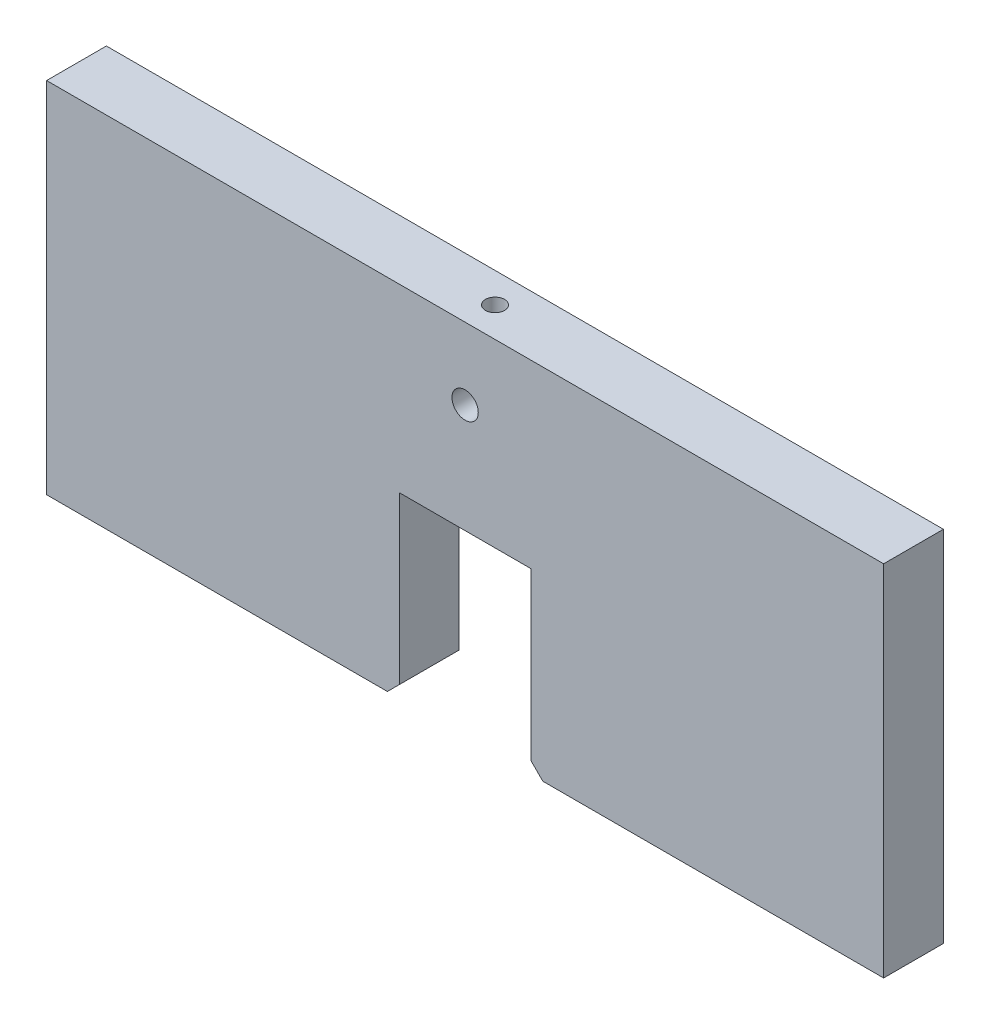
ISO-10303-21;
HEADER;
FILE_DESCRIPTION(('STEP AP214'),'2;1');
FILE_NAME('part.step','',(''),(''),'','','');
FILE_SCHEMA(('AUTOMOTIVE_DESIGN { 1 0 10303 214 1 1 1 1 }'));
ENDSEC;
DATA;
#1=APPLICATION_CONTEXT('core data for automotive mechanical design processes');
#2=APPLICATION_PROTOCOL_DEFINITION('international standard','automotive_design',2000,#1);
#3=PRODUCT_CONTEXT('',#1,'mechanical');
#4=PRODUCT('Part','Part','',(#3));
#5=PRODUCT_RELATED_PRODUCT_CATEGORY('part','',(#4));
#6=PRODUCT_DEFINITION_FORMATION('','',#4);
#7=PRODUCT_DEFINITION_CONTEXT('part definition',#1,'design');
#8=PRODUCT_DEFINITION('design','',#6,#7);
#9=PRODUCT_DEFINITION_SHAPE('','',#8);
#10=(LENGTH_UNIT() NAMED_UNIT(*) SI_UNIT(.MILLI.,.METRE.));
#11=(NAMED_UNIT(*) PLANE_ANGLE_UNIT() SI_UNIT($,.RADIAN.));
#12=(NAMED_UNIT(*) SI_UNIT($,.STERADIAN.) SOLID_ANGLE_UNIT());
#13=UNCERTAINTY_MEASURE_WITH_UNIT(LENGTH_MEASURE(1.E-05),#10,'distance_accuracy_value','');
#14=(GEOMETRIC_REPRESENTATION_CONTEXT(3) GLOBAL_UNCERTAINTY_ASSIGNED_CONTEXT((#13)) GLOBAL_UNIT_ASSIGNED_CONTEXT((#10,
#11,#12)) REPRESENTATION_CONTEXT('',''));
#15=CARTESIAN_POINT('',(0.,0.,0.));
#16=DIRECTION('',(0.,0.,1.));
#17=DIRECTION('',(1.,0.,0.));
#18=AXIS2_PLACEMENT_3D('',#15,#16,#17);
#19=CARTESIAN_POINT('',(-350.,232.421392473446,25.));
#20=DIRECTION('',(1.,0.,0.));
#21=DIRECTION('',(0.,1.,0.));
#22=AXIS2_PLACEMENT_3D('',#19,#20,#21);
#23=PLANE('',#22);
#24=DIRECTION('',(0.,-1.,0.));
#25=VECTOR('',#24,1.);
#26=CARTESIAN_POINT('',(-350.,232.421392473446,-25.));
#27=LINE('',#26,#25);
#28=CARTESIAN_POINT('',(-350.,232.421392473446,-25.));
#29=VERTEX_POINT('',#28);
#30=CARTESIAN_POINT('',(-350.,-67.5786075265541,-25.));
#31=VERTEX_POINT('',#30);
#32=EDGE_CURVE('E141',#29,#31,#27,.T.);
#33=ORIENTED_EDGE('',*,*,#32,.T.);
#34=DIRECTION('',(0.,0.,-1.));
#35=VECTOR('',#34,1.);
#36=CARTESIAN_POINT('',(-350.,-67.5786075265541,25.));
#37=LINE('',#36,#35);
#38=CARTESIAN_POINT('',(-350.,-67.5786075265541,25.));
#39=VERTEX_POINT('',#38);
#40=EDGE_CURVE('E11',#39,#31,#37,.T.);
#41=ORIENTED_EDGE('',*,*,#40,.F.);
#42=DIRECTION('',(0.,-1.,0.));
#43=VECTOR('',#42,1.);
#44=CARTESIAN_POINT('',(-350.,232.421392473446,25.));
#45=LINE('',#44,#43);
#46=CARTESIAN_POINT('',(-350.,232.421392473446,25.));
#47=VERTEX_POINT('',#46);
#48=EDGE_CURVE('E160',#47,#39,#45,.T.);
#49=ORIENTED_EDGE('',*,*,#48,.F.);
#50=DIRECTION('',(0.,0.,-1.));
#51=VECTOR('',#50,1.);
#52=CARTESIAN_POINT('',(-350.,232.421392473446,25.));
#53=LINE('',#52,#51);
#54=EDGE_CURVE('E137',#47,#29,#53,.T.);
#55=ORIENTED_EDGE('',*,*,#54,.T.);
#56=EDGE_LOOP('',(#33,#41,#49,#55));
#57=FACE_BOUND('',#56,.T.);
#58=ADVANCED_FACE('F33',(#57),#23,.F.);
#59=CARTESIAN_POINT('',(-350.,-67.5786075265541,25.));
#60=DIRECTION('',(0.,1.,0.));
#61=DIRECTION('',(-1.,0.,0.));
#62=AXIS2_PLACEMENT_3D('',#59,#60,#61);
#63=PLANE('',#62);
#64=CARTESIAN_POINT('',(-80.,-67.5786075265541,0.));
#65=DIRECTION('',(0.,-1.,0.));
#66=DIRECTION('',(1.,0.,0.));
#67=AXIS2_PLACEMENT_3D('',#64,#65,#66);
#68=CIRCLE('',#67,8.);
#69=CARTESIAN_POINT('',(-72.,-67.5786075265541,0.));
#70=VERTEX_POINT('',#69);
#71=EDGE_CURVE('E219',#70,#70,#68,.T.);
#72=ORIENTED_EDGE('',*,*,#71,.F.);
#73=EDGE_LOOP('',(#72));
#74=FACE_BOUND('',#73,.T.);
#75=DIRECTION('',(1.,0.,0.));
#76=VECTOR('',#75,1.);
#77=CARTESIAN_POINT('',(-350.,-67.5786075265541,-25.));
#78=LINE('',#77,#76);
#79=CARTESIAN_POINT('',(-65.,-67.5786075265541,-25.));
#80=VERTEX_POINT('',#79);
#81=EDGE_CURVE('E144',#31,#80,#78,.T.);
#82=ORIENTED_EDGE('',*,*,#81,.T.);
#83=DIRECTION('',(0.,0.,-1.));
#84=VECTOR('',#83,1.);
#85=CARTESIAN_POINT('',(-65.,-67.5786075265541,25.));
#86=LINE('',#85,#84);
#87=CARTESIAN_POINT('',(-65.,-67.5786075265541,25.));
#88=VERTEX_POINT('',#87);
#89=EDGE_CURVE('E41',#88,#80,#86,.T.);
#90=ORIENTED_EDGE('',*,*,#89,.F.);
#91=DIRECTION('',(1.,0.,0.));
#92=VECTOR('',#91,1.);
#93=CARTESIAN_POINT('',(-350.,-67.5786075265541,25.));
#94=LINE('',#93,#92);
#95=EDGE_CURVE('E98',#39,#88,#94,.T.);
#96=ORIENTED_EDGE('',*,*,#95,.F.);
#97=ORIENTED_EDGE('',*,*,#40,.T.);
#98=EDGE_LOOP('',(#82,#90,#96,#97));
#99=FACE_BOUND('',#98,.T.);
#100=ADVANCED_FACE('F255',(#74,#99),#63,.F.);
#101=CARTESIAN_POINT('',(-65.,-67.5786075265541,25.));
#102=DIRECTION('',(-0.707106781186546,0.707106781186549,0.));
#103=DIRECTION('',(-0.707106781186549,-0.707106781186546,0.));
#104=AXIS2_PLACEMENT_3D('',#101,#102,#103);
#105=PLANE('',#104);
#106=DIRECTION('',(0.707106781186549,0.707106781186546,0.));
#107=VECTOR('',#106,1.);
#108=CARTESIAN_POINT('',(-65.,-67.5786075265541,-25.));
#109=LINE('',#108,#107);
#110=CARTESIAN_POINT('',(-55.,-57.5786075265541,-25.));
#111=VERTEX_POINT('',#110);
#112=EDGE_CURVE('E147',#80,#111,#109,.T.);
#113=ORIENTED_EDGE('',*,*,#112,.T.);
#114=DIRECTION('',(0.,0.,-1.));
#115=VECTOR('',#114,1.);
#116=CARTESIAN_POINT('',(-55.,-57.5786075265541,25.));
#117=LINE('',#116,#115);
#118=CARTESIAN_POINT('',(-55.,-57.5786075265541,25.));
#119=VERTEX_POINT('',#118);
#120=EDGE_CURVE('E173',#119,#111,#117,.T.);
#121=ORIENTED_EDGE('',*,*,#120,.F.);
#122=DIRECTION('',(0.707106781186549,0.707106781186546,0.));
#123=VECTOR('',#122,1.);
#124=CARTESIAN_POINT('',(-65.,-67.5786075265541,25.));
#125=LINE('',#124,#123);
#126=EDGE_CURVE('E181',#88,#119,#125,.T.);
#127=ORIENTED_EDGE('',*,*,#126,.F.);
#128=ORIENTED_EDGE('',*,*,#89,.T.);
#129=EDGE_LOOP('',(#113,#121,#127,#128));
#130=FACE_BOUND('',#129,.T.);
#131=ADVANCED_FACE('F179',(#130),#105,.F.);
#132=CARTESIAN_POINT('',(-55.,-57.5786075265541,25.));
#133=DIRECTION('',(-1.,0.,0.));
#134=DIRECTION('',(0.,0.,1.));
#135=AXIS2_PLACEMENT_3D('',#132,#133,#134);
#136=PLANE('',#135);
#137=DIRECTION('',(0.,1.,0.));
#138=VECTOR('',#137,1.);
#139=CARTESIAN_POINT('',(-55.,-57.5786075265541,-25.));
#140=LINE('',#139,#138);
#141=CARTESIAN_POINT('',(-55.,81.4213924734459,-25.));
#142=VERTEX_POINT('',#141);
#143=EDGE_CURVE('E149',#111,#142,#140,.T.);
#144=ORIENTED_EDGE('',*,*,#143,.T.);
#145=DIRECTION('',(0.,0.,-1.));
#146=VECTOR('',#145,1.);
#147=CARTESIAN_POINT('',(-55.,81.4213924734459,25.));
#148=LINE('',#147,#146);
#149=CARTESIAN_POINT('',(-55.,81.4213924734459,25.));
#150=VERTEX_POINT('',#149);
#151=EDGE_CURVE('E170',#150,#142,#148,.T.);
#152=ORIENTED_EDGE('',*,*,#151,.F.);
#153=DIRECTION('',(0.,1.,0.));
#154=VECTOR('',#153,1.);
#155=CARTESIAN_POINT('',(-55.,-57.5786075265541,25.));
#156=LINE('',#155,#154);
#157=EDGE_CURVE('E199',#119,#150,#156,.T.);
#158=ORIENTED_EDGE('',*,*,#157,.F.);
#159=ORIENTED_EDGE('',*,*,#120,.T.);
#160=EDGE_LOOP('',(#144,#152,#158,#159));
#161=FACE_BOUND('',#160,.T.);
#162=ADVANCED_FACE('F190',(#161),#136,.F.);
#163=CARTESIAN_POINT('',(-55.,81.4213924734459,25.));
#164=DIRECTION('',(0.,1.,0.));
#165=DIRECTION('',(0.,0.,1.));
#166=AXIS2_PLACEMENT_3D('',#163,#164,#165);
#167=PLANE('',#166);
#168=DIRECTION('',(1.,0.,0.));
#169=VECTOR('',#168,1.);
#170=CARTESIAN_POINT('',(-55.,81.4213924734459,-25.));
#171=LINE('',#170,#169);
#172=CARTESIAN_POINT('',(55.,81.4213924734459,-25.));
#173=VERTEX_POINT('',#172);
#174=EDGE_CURVE('E151',#142,#173,#171,.T.);
#175=ORIENTED_EDGE('',*,*,#174,.T.);
#176=DIRECTION('',(0.,0.,-1.));
#177=VECTOR('',#176,1.);
#178=CARTESIAN_POINT('',(55.,81.4213924734459,25.));
#179=LINE('',#178,#177);
#180=CARTESIAN_POINT('',(55.,81.4213924734459,25.));
#181=VERTEX_POINT('',#180);
#182=EDGE_CURVE('E167',#181,#173,#179,.T.);
#183=ORIENTED_EDGE('',*,*,#182,.F.);
#184=DIRECTION('',(1.,0.,0.));
#185=VECTOR('',#184,1.);
#186=CARTESIAN_POINT('',(-55.,81.4213924734459,25.));
#187=LINE('',#186,#185);
#188=EDGE_CURVE('E196',#150,#181,#187,.T.);
#189=ORIENTED_EDGE('',*,*,#188,.F.);
#190=ORIENTED_EDGE('',*,*,#151,.T.);
#191=EDGE_LOOP('',(#175,#183,#189,#190));
#192=FACE_BOUND('',#191,.T.);
#193=ADVANCED_FACE('F194',(#192),#167,.F.);
#194=CARTESIAN_POINT('',(55.,-57.5786075265541,25.));
#195=DIRECTION('',(1.,0.,0.));
#196=DIRECTION('',(0.,1.,0.));
#197=AXIS2_PLACEMENT_3D('',#194,#195,#196);
#198=PLANE('',#197);
#199=DIRECTION('',(0.,-1.,0.));
#200=VECTOR('',#199,1.);
#201=CARTESIAN_POINT('',(55.,-57.5786075265541,-25.));
#202=LINE('',#201,#200);
#203=CARTESIAN_POINT('',(55.,-57.5786075265541,-25.));
#204=VERTEX_POINT('',#203);
#205=EDGE_CURVE('E153',#173,#204,#202,.T.);
#206=ORIENTED_EDGE('',*,*,#205,.T.);
#207=DIRECTION('',(0.,0.,-1.));
#208=VECTOR('',#207,1.);
#209=CARTESIAN_POINT('',(55.,-57.5786075265541,25.));
#210=LINE('',#209,#208);
#211=CARTESIAN_POINT('',(55.,-57.5786075265541,25.));
#212=VERTEX_POINT('',#211);
#213=EDGE_CURVE('E164',#212,#204,#210,.T.);
#214=ORIENTED_EDGE('',*,*,#213,.F.);
#215=DIRECTION('',(0.,-1.,0.));
#216=VECTOR('',#215,1.);
#217=CARTESIAN_POINT('',(55.,-57.5786075265541,25.));
#218=LINE('',#217,#216);
#219=EDGE_CURVE('E198',#181,#212,#218,.T.);
#220=ORIENTED_EDGE('',*,*,#219,.F.);
#221=ORIENTED_EDGE('',*,*,#182,.T.);
#222=EDGE_LOOP('',(#206,#214,#220,#221));
#223=FACE_BOUND('',#222,.T.);
#224=ADVANCED_FACE('F251',(#223),#198,.F.);
#225=CARTESIAN_POINT('',(65.,-67.5786075265541,25.));
#226=DIRECTION('',(0.707106781186546,0.707106781186549,0.));
#227=DIRECTION('',(-0.707106781186549,0.707106781186546,0.));
#228=AXIS2_PLACEMENT_3D('',#225,#226,#227);
#229=PLANE('',#228);
#230=DIRECTION('',(0.707106781186549,-0.707106781186546,0.));
#231=VECTOR('',#230,1.);
#232=CARTESIAN_POINT('',(65.,-67.5786075265541,-25.));
#233=LINE('',#232,#231);
#234=CARTESIAN_POINT('',(65.,-67.5786075265541,-25.));
#235=VERTEX_POINT('',#234);
#236=EDGE_CURVE('E155',#204,#235,#233,.T.);
#237=ORIENTED_EDGE('',*,*,#236,.T.);
#238=DIRECTION('',(0.,0.,-1.));
#239=VECTOR('',#238,1.);
#240=CARTESIAN_POINT('',(65.,-67.5786075265541,25.));
#241=LINE('',#240,#239);
#242=CARTESIAN_POINT('',(65.,-67.5786075265541,25.));
#243=VERTEX_POINT('',#242);
#244=EDGE_CURVE('E132',#243,#235,#241,.T.);
#245=ORIENTED_EDGE('',*,*,#244,.F.);
#246=DIRECTION('',(0.707106781186549,-0.707106781186546,0.));
#247=VECTOR('',#246,1.);
#248=CARTESIAN_POINT('',(65.,-67.5786075265541,25.));
#249=LINE('',#248,#247);
#250=EDGE_CURVE('E123',#212,#243,#249,.T.);
#251=ORIENTED_EDGE('',*,*,#250,.F.);
#252=ORIENTED_EDGE('',*,*,#213,.T.);
#253=EDGE_LOOP('',(#237,#245,#251,#252));
#254=FACE_BOUND('',#253,.T.);
#255=ADVANCED_FACE('F241',(#254),#229,.F.);
#256=CARTESIAN_POINT('',(350.,-67.5786075265541,25.));
#257=DIRECTION('',(0.,1.,0.));
#258=DIRECTION('',(0.,0.,1.));
#259=AXIS2_PLACEMENT_3D('',#256,#257,#258);
#260=PLANE('',#259);
#261=CARTESIAN_POINT('',(80.,-67.578607526554,0.));
#262=DIRECTION('',(0.,-1.,0.));
#263=DIRECTION('',(1.,0.,0.));
#264=AXIS2_PLACEMENT_3D('',#261,#262,#263);
#265=CIRCLE('',#264,8.);
#266=CARTESIAN_POINT('',(88.,-67.578607526554,0.));
#267=VERTEX_POINT('',#266);
#268=EDGE_CURVE('E225',#267,#267,#265,.T.);
#269=ORIENTED_EDGE('',*,*,#268,.F.);
#270=EDGE_LOOP('',(#269));
#271=FACE_BOUND('',#270,.T.);
#272=DIRECTION('',(1.,0.,0.));
#273=VECTOR('',#272,1.);
#274=CARTESIAN_POINT('',(350.,-67.5786075265541,-25.));
#275=LINE('',#274,#273);
#276=CARTESIAN_POINT('',(350.,-67.5786075265541,-25.));
#277=VERTEX_POINT('',#276);
#278=EDGE_CURVE('E131',#235,#277,#275,.T.);
#279=ORIENTED_EDGE('',*,*,#278,.T.);
#280=DIRECTION('',(0.,0.,-1.));
#281=VECTOR('',#280,1.);
#282=CARTESIAN_POINT('',(350.,-67.5786075265541,25.));
#283=LINE('',#282,#281);
#284=CARTESIAN_POINT('',(350.,-67.5786075265541,25.));
#285=VERTEX_POINT('',#284);
#286=EDGE_CURVE('E128',#285,#277,#283,.T.);
#287=ORIENTED_EDGE('',*,*,#286,.F.);
#288=DIRECTION('',(1.,0.,0.));
#289=VECTOR('',#288,1.);
#290=CARTESIAN_POINT('',(350.,-67.5786075265541,25.));
#291=LINE('',#290,#289);
#292=EDGE_CURVE('E117',#243,#285,#291,.T.);
#293=ORIENTED_EDGE('',*,*,#292,.F.);
#294=ORIENTED_EDGE('',*,*,#244,.T.);
#295=EDGE_LOOP('',(#279,#287,#293,#294));
#296=FACE_BOUND('',#295,.T.);
#297=ADVANCED_FACE('F129',(#271,#296),#260,.F.);
#298=CARTESIAN_POINT('',(350.,232.421392473446,25.));
#299=DIRECTION('',(-1.,0.,0.));
#300=DIRECTION('',(0.,-1.,0.));
#301=AXIS2_PLACEMENT_3D('',#298,#299,#300);
#302=PLANE('',#301);
#303=DIRECTION('',(0.,1.,0.));
#304=VECTOR('',#303,1.);
#305=CARTESIAN_POINT('',(350.,232.421392473446,-25.));
#306=LINE('',#305,#304);
#307=CARTESIAN_POINT('',(350.,232.421392473446,-25.));
#308=VERTEX_POINT('',#307);
#309=EDGE_CURVE('E84',#277,#308,#306,.T.);
#310=ORIENTED_EDGE('',*,*,#309,.T.);
#311=DIRECTION('',(0.,0.,-1.));
#312=VECTOR('',#311,1.);
#313=CARTESIAN_POINT('',(350.,232.421392473446,25.));
#314=LINE('',#313,#312);
#315=CARTESIAN_POINT('',(350.,232.421392473446,25.));
#316=VERTEX_POINT('',#315);
#317=EDGE_CURVE('E133',#316,#308,#314,.T.);
#318=ORIENTED_EDGE('',*,*,#317,.F.);
#319=DIRECTION('',(0.,1.,0.));
#320=VECTOR('',#319,1.);
#321=CARTESIAN_POINT('',(350.,232.421392473446,25.));
#322=LINE('',#321,#320);
#323=EDGE_CURVE('E121',#285,#316,#322,.T.);
#324=ORIENTED_EDGE('',*,*,#323,.F.);
#325=ORIENTED_EDGE('',*,*,#286,.T.);
#326=EDGE_LOOP('',(#310,#318,#324,#325));
#327=FACE_BOUND('',#326,.T.);
#328=ADVANCED_FACE('F135',(#327),#302,.F.);
#329=CARTESIAN_POINT('',(350.,232.421392473446,25.));
#330=DIRECTION('',(0.,-1.,0.));
#331=DIRECTION('',(0.,0.,-1.));
#332=AXIS2_PLACEMENT_3D('',#329,#330,#331);
#333=PLANE('',#332);
#334=CARTESIAN_POINT('',(0.,232.421392473446,0.));
#335=DIRECTION('',(0.,1.,0.));
#336=DIRECTION('',(0.,0.,1.));
#337=AXIS2_PLACEMENT_3D('',#334,#335,#336);
#338=CIRCLE('',#337,8.);
#339=CARTESIAN_POINT('',(0.,232.421392473446,8.));
#340=VERTEX_POINT('',#339);
#341=EDGE_CURVE('E213',#340,#340,#338,.T.);
#342=ORIENTED_EDGE('',*,*,#341,.F.);
#343=EDGE_LOOP('',(#342));
#344=FACE_BOUND('',#343,.T.);
#345=DIRECTION('',(-1.,0.,0.));
#346=VECTOR('',#345,1.);
#347=CARTESIAN_POINT('',(350.,232.421392473446,-25.));
#348=LINE('',#347,#346);
#349=EDGE_CURVE('E90',#308,#29,#348,.T.);
#350=ORIENTED_EDGE('',*,*,#349,.T.);
#351=ORIENTED_EDGE('',*,*,#54,.F.);
#352=DIRECTION('',(-1.,0.,0.));
#353=VECTOR('',#352,1.);
#354=CARTESIAN_POINT('',(350.,232.421392473446,25.));
#355=LINE('',#354,#353);
#356=EDGE_CURVE('E49',#316,#47,#355,.T.);
#357=ORIENTED_EDGE('',*,*,#356,.F.);
#358=ORIENTED_EDGE('',*,*,#317,.T.);
#359=EDGE_LOOP('',(#350,#351,#357,#358));
#360=FACE_BOUND('',#359,.T.);
#361=ADVANCED_FACE('F248',(#344,#360),#333,.F.);
#362=CARTESIAN_POINT('',(0.,0.,25.));
#363=DIRECTION('',(0.,0.,1.));
#364=DIRECTION('',(1.,0.,0.));
#365=AXIS2_PLACEMENT_3D('',#362,#363,#364);
#366=PLANE('',#365);
#367=CARTESIAN_POINT('',(0.,172.421392473446,25.));
#368=DIRECTION('',(0.,0.,1.));
#369=DIRECTION('',(1.,0.,0.));
#370=AXIS2_PLACEMENT_3D('',#367,#368,#369);
#371=CIRCLE('',#370,11.);
#372=CARTESIAN_POINT('',(11.,172.421392473446,25.));
#373=VERTEX_POINT('',#372);
#374=EDGE_CURVE('E209',#373,#373,#371,.T.);
#375=ORIENTED_EDGE('',*,*,#374,.F.);
#376=EDGE_LOOP('',(#375));
#377=FACE_BOUND('',#376,.T.);
#378=ORIENTED_EDGE('',*,*,#48,.T.);
#379=ORIENTED_EDGE('',*,*,#95,.T.);
#380=ORIENTED_EDGE('',*,*,#126,.T.);
#381=ORIENTED_EDGE('',*,*,#157,.T.);
#382=ORIENTED_EDGE('',*,*,#188,.T.);
#383=ORIENTED_EDGE('',*,*,#219,.T.);
#384=ORIENTED_EDGE('',*,*,#250,.T.);
#385=ORIENTED_EDGE('',*,*,#292,.T.);
#386=ORIENTED_EDGE('',*,*,#323,.T.);
#387=ORIENTED_EDGE('',*,*,#356,.T.);
#388=EDGE_LOOP('',(#378,#379,#380,#381,#382,#383,#384,#385,#386,#387));
#389=FACE_BOUND('',#388,.T.);
#390=ADVANCED_FACE('F119',(#377,#389),#366,.T.);
#391=CARTESIAN_POINT('',(0.,0.,-25.));
#392=DIRECTION('',(0.,0.,1.));
#393=DIRECTION('',(1.,0.,0.));
#394=AXIS2_PLACEMENT_3D('',#391,#392,#393);
#395=PLANE('',#394);
#396=CARTESIAN_POINT('',(0.,172.421392473446,-25.));
#397=DIRECTION('',(0.,0.,1.));
#398=DIRECTION('',(1.,0.,0.));
#399=AXIS2_PLACEMENT_3D('',#396,#397,#398);
#400=CIRCLE('',#399,11.);
#401=CARTESIAN_POINT('',(11.,172.421392473446,-25.));
#402=VERTEX_POINT('',#401);
#403=EDGE_CURVE('E145',#402,#402,#400,.T.);
#404=ORIENTED_EDGE('',*,*,#403,.T.);
#405=EDGE_LOOP('',(#404));
#406=FACE_BOUND('',#405,.T.);
#407=ORIENTED_EDGE('',*,*,#32,.F.);
#408=ORIENTED_EDGE('',*,*,#349,.F.);
#409=ORIENTED_EDGE('',*,*,#309,.F.);
#410=ORIENTED_EDGE('',*,*,#278,.F.);
#411=ORIENTED_EDGE('',*,*,#236,.F.);
#412=ORIENTED_EDGE('',*,*,#205,.F.);
#413=ORIENTED_EDGE('',*,*,#174,.F.);
#414=ORIENTED_EDGE('',*,*,#143,.F.);
#415=ORIENTED_EDGE('',*,*,#112,.F.);
#416=ORIENTED_EDGE('',*,*,#81,.F.);
#417=EDGE_LOOP('',(#407,#408,#409,#410,#411,#412,#413,#414,#415,#416));
#418=FACE_BOUND('',#417,.T.);
#419=ADVANCED_FACE('F185',(#406,#418),#395,.F.);
#420=CARTESIAN_POINT('',(0.,172.421392473446,-25.));
#421=DIRECTION('',(0.,0.,1.));
#422=DIRECTION('',(1.,0.,0.));
#423=AXIS2_PLACEMENT_3D('',#420,#421,#422);
#424=CYLINDRICAL_SURFACE('',#423,11.);
#425=ORIENTED_EDGE('',*,*,#403,.F.);
#426=EDGE_LOOP('',(#425));
#427=FACE_BOUND('',#426,.T.);
#428=ORIENTED_EDGE('',*,*,#374,.T.);
#429=EDGE_LOOP('',(#428));
#430=FACE_BOUND('',#429,.T.);
#431=ADVANCED_FACE('F325',(#427,#430),#424,.F.);
#432=CARTESIAN_POINT('',(0.,197.421392473446,0.));
#433=DIRECTION('',(0.,1.,0.));
#434=DIRECTION('',(0.,0.,1.));
#435=AXIS2_PLACEMENT_3D('',#432,#433,#434);
#436=CYLINDRICAL_SURFACE('',#435,8.);
#437=CARTESIAN_POINT('',(0.,197.421392473446,0.));
#438=DIRECTION('',(0.,1.,0.));
#439=DIRECTION('',(0.,0.,1.));
#440=AXIS2_PLACEMENT_3D('',#437,#438,#439);
#441=CIRCLE('',#440,8.);
#442=CARTESIAN_POINT('',(0.,197.421392473446,8.));
#443=VERTEX_POINT('',#442);
#444=EDGE_CURVE('E212',#443,#443,#441,.T.);
#445=ORIENTED_EDGE('',*,*,#444,.F.);
#446=EDGE_LOOP('',(#445));
#447=FACE_BOUND('',#446,.T.);
#448=ORIENTED_EDGE('',*,*,#341,.T.);
#449=EDGE_LOOP('',(#448));
#450=FACE_BOUND('',#449,.T.);
#451=ADVANCED_FACE('F335',(#447,#450),#436,.F.);
#452=CARTESIAN_POINT('',(0.,197.421392473446,0.));
#453=DIRECTION('',(0.,1.,0.));
#454=DIRECTION('',(0.,0.,1.));
#455=AXIS2_PLACEMENT_3D('',#452,#453,#454);
#456=PLANE('',#455);
#457=ORIENTED_EDGE('',*,*,#444,.T.);
#458=EDGE_LOOP('',(#457));
#459=FACE_BOUND('',#458,.T.);
#460=ADVANCED_FACE('F352',(#459),#456,.T.);
#461=CARTESIAN_POINT('',(-80.,-37.5786075265541,0.));
#462=DIRECTION('',(0.,-1.,0.));
#463=DIRECTION('',(1.,0.,0.));
#464=AXIS2_PLACEMENT_3D('',#461,#462,#463);
#465=CYLINDRICAL_SURFACE('',#464,8.);
#466=CARTESIAN_POINT('',(-80.,-37.5786075265541,0.));
#467=DIRECTION('',(0.,-1.,0.));
#468=DIRECTION('',(1.,0.,0.));
#469=AXIS2_PLACEMENT_3D('',#466,#467,#468);
#470=CIRCLE('',#469,8.);
#471=CARTESIAN_POINT('',(-72.,-37.5786075265541,0.));
#472=VERTEX_POINT('',#471);
#473=EDGE_CURVE('E216',#472,#472,#470,.T.);
#474=ORIENTED_EDGE('',*,*,#473,.F.);
#475=EDGE_LOOP('',(#474));
#476=FACE_BOUND('',#475,.T.);
#477=ORIENTED_EDGE('',*,*,#71,.T.);
#478=EDGE_LOOP('',(#477));
#479=FACE_BOUND('',#478,.T.);
#480=ADVANCED_FACE('F361',(#476,#479),#465,.F.);
#481=CARTESIAN_POINT('',(-80.,-37.5786075265541,0.));
#482=DIRECTION('',(0.,-1.,0.));
#483=DIRECTION('',(1.,0.,0.));
#484=AXIS2_PLACEMENT_3D('',#481,#482,#483);
#485=PLANE('',#484);
#486=ORIENTED_EDGE('',*,*,#473,.T.);
#487=EDGE_LOOP('',(#486));
#488=FACE_BOUND('',#487,.T.);
#489=ADVANCED_FACE('F236',(#488),#485,.T.);
#490=CARTESIAN_POINT('',(80.,-37.578607526554,0.));
#491=DIRECTION('',(0.,-1.,0.));
#492=DIRECTION('',(1.,0.,0.));
#493=AXIS2_PLACEMENT_3D('',#490,#491,#492);
#494=CYLINDRICAL_SURFACE('',#493,8.);
#495=CARTESIAN_POINT('',(80.,-37.578607526554,0.));
#496=DIRECTION('',(0.,-1.,0.));
#497=DIRECTION('',(1.,0.,0.));
#498=AXIS2_PLACEMENT_3D('',#495,#496,#497);
#499=CIRCLE('',#498,8.);
#500=CARTESIAN_POINT('',(88.,-37.578607526554,0.));
#501=VERTEX_POINT('',#500);
#502=EDGE_CURVE('E222',#501,#501,#499,.T.);
#503=ORIENTED_EDGE('',*,*,#502,.F.);
#504=EDGE_LOOP('',(#503));
#505=FACE_BOUND('',#504,.T.);
#506=ORIENTED_EDGE('',*,*,#268,.T.);
#507=EDGE_LOOP('',(#506));
#508=FACE_BOUND('',#507,.T.);
#509=ADVANCED_FACE('F233',(#505,#508),#494,.F.);
#510=CARTESIAN_POINT('',(80.,-37.578607526554,0.));
#511=DIRECTION('',(0.,-1.,0.));
#512=DIRECTION('',(1.,0.,0.));
#513=AXIS2_PLACEMENT_3D('',#510,#511,#512);
#514=PLANE('',#513);
#515=ORIENTED_EDGE('',*,*,#502,.T.);
#516=EDGE_LOOP('',(#515));
#517=FACE_BOUND('',#516,.T.);
#518=ADVANCED_FACE('F231',(#517),#514,.T.);
#519=CLOSED_SHELL('',(#58,#100,#131,#162,#193,#224,#255,#297,#328,#361,#390,#419,#431,#451,#460,
#480,#489,#509,#518));
#520=MANIFOLD_SOLID_BREP('B2',#519);
#521=ADVANCED_BREP_SHAPE_REPRESENTATION('',(#18,#520),#14);
#522=SHAPE_DEFINITION_REPRESENTATION(#9,#521);
ENDSEC;
END-ISO-10303-21;
